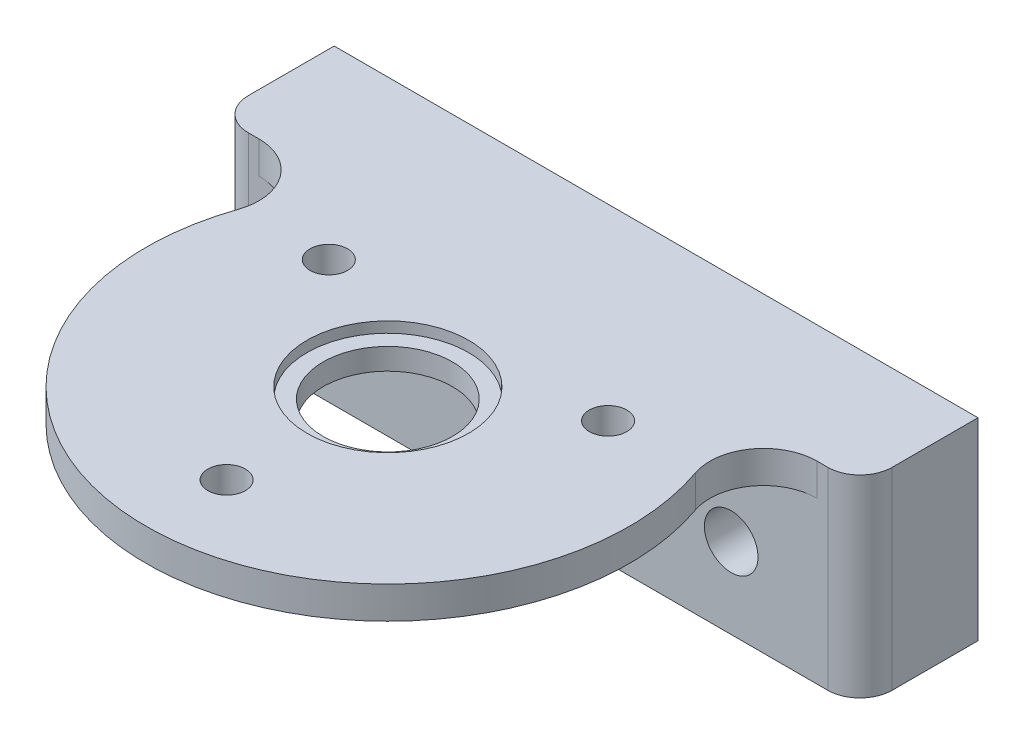
ISO-10303-21;
HEADER;
FILE_DESCRIPTION(('STEP AP214'),'2;1');
FILE_NAME('part.step','',(''),(''),'','','');
FILE_SCHEMA(('AUTOMOTIVE_DESIGN { 1 0 10303 214 1 1 1 1 }'));
ENDSEC;
DATA;
#1=APPLICATION_CONTEXT('core data for automotive mechanical design processes');
#2=APPLICATION_PROTOCOL_DEFINITION('international standard','automotive_design',2000,#1);
#3=PRODUCT_CONTEXT('',#1,'mechanical');
#4=PRODUCT('Part','Part','',(#3));
#5=PRODUCT_RELATED_PRODUCT_CATEGORY('part','',(#4));
#6=PRODUCT_DEFINITION_FORMATION('','',#4);
#7=PRODUCT_DEFINITION_CONTEXT('part definition',#1,'design');
#8=PRODUCT_DEFINITION('design','',#6,#7);
#9=PRODUCT_DEFINITION_SHAPE('','',#8);
#10=(LENGTH_UNIT() NAMED_UNIT(*) SI_UNIT(.MILLI.,.METRE.));
#11=(NAMED_UNIT(*) PLANE_ANGLE_UNIT() SI_UNIT($,.RADIAN.));
#12=(NAMED_UNIT(*) SI_UNIT($,.STERADIAN.) SOLID_ANGLE_UNIT());
#13=UNCERTAINTY_MEASURE_WITH_UNIT(LENGTH_MEASURE(1.E-05),#10,'distance_accuracy_value','');
#14=(GEOMETRIC_REPRESENTATION_CONTEXT(3) GLOBAL_UNCERTAINTY_ASSIGNED_CONTEXT((#13)) GLOBAL_UNIT_ASSIGNED_CONTEXT((#10,
#11,#12)) REPRESENTATION_CONTEXT('',''));
#15=CARTESIAN_POINT('',(0.,0.,0.));
#16=DIRECTION('',(0.,0.,1.));
#17=DIRECTION('',(1.,0.,0.));
#18=AXIS2_PLACEMENT_3D('',#15,#16,#17);
#19=CARTESIAN_POINT('',(0.,2.,0.));
#20=DIRECTION('',(0.,-1.,0.));
#21=DIRECTION('',(0.,0.,-1.));
#22=AXIS2_PLACEMENT_3D('',#19,#20,#21);
#23=CYLINDRICAL_SURFACE('',#22,6.025);
#24=CARTESIAN_POINT('',(0.,2.,0.));
#25=DIRECTION('',(0.,1.,0.));
#26=DIRECTION('',(0.,0.,1.));
#27=AXIS2_PLACEMENT_3D('',#24,#25,#26);
#28=CIRCLE('',#27,6.025);
#29=CARTESIAN_POINT('',(0.,2.,6.025));
#30=VERTEX_POINT('',#29);
#31=EDGE_CURVE('E183',#30,#30,#28,.T.);
#32=ORIENTED_EDGE('',*,*,#31,.T.);
#33=EDGE_LOOP('',(#32));
#34=FACE_BOUND('',#33,.T.);
#35=CARTESIAN_POINT('',(0.,0.,0.));
#36=DIRECTION('',(0.,1.,0.));
#37=DIRECTION('',(0.,0.,1.));
#38=AXIS2_PLACEMENT_3D('',#35,#36,#37);
#39=CIRCLE('',#38,6.025);
#40=CARTESIAN_POINT('',(0.,0.,6.025));
#41=VERTEX_POINT('',#40);
#42=EDGE_CURVE('E182',#41,#41,#39,.T.);
#43=ORIENTED_EDGE('',*,*,#42,.F.);
#44=EDGE_LOOP('',(#43));
#45=FACE_BOUND('',#44,.T.);
#46=ADVANCED_FACE('F39',(#34,#45),#23,.F.);
#47=CARTESIAN_POINT('',(0.,2.,0.));
#48=DIRECTION('',(0.,1.,0.));
#49=DIRECTION('',(0.,0.,1.));
#50=AXIS2_PLACEMENT_3D('',#47,#48,#49);
#51=PLANE('',#50);
#52=ORIENTED_EDGE('',*,*,#31,.F.);
#53=EDGE_LOOP('',(#52));
#54=FACE_BOUND('',#53,.T.);
#55=CARTESIAN_POINT('',(0.,2.,0.));
#56=DIRECTION('',(0.,1.,0.));
#57=DIRECTION('',(0.,0.,1.));
#58=AXIS2_PLACEMENT_3D('',#55,#56,#57);
#59=CIRCLE('',#58,7.525);
#60=CARTESIAN_POINT('',(0.,2.,7.525));
#61=VERTEX_POINT('',#60);
#62=EDGE_CURVE('E177',#61,#61,#59,.F.);
#63=ORIENTED_EDGE('',*,*,#62,.F.);
#64=EDGE_LOOP('',(#63));
#65=FACE_BOUND('',#64,.T.);
#66=ADVANCED_FACE('F275',(#54,#65),#51,.T.);
#67=CARTESIAN_POINT('',(0.,0.,0.));
#68=DIRECTION('',(0.,1.,0.));
#69=DIRECTION('',(0.,0.,1.));
#70=AXIS2_PLACEMENT_3D('',#67,#68,#69);
#71=PLANE('',#70);
#72=CARTESIAN_POINT('',(-13.0120316918612,0.,-7.51250000000006));
#73=DIRECTION('',(0.,1.,0.));
#74=DIRECTION('',(0.,0.,1.));
#75=AXIS2_PLACEMENT_3D('',#72,#73,#74);
#76=CIRCLE('',#75,1.75);
#77=CARTESIAN_POINT('',(-13.0120316918612,0.,-5.76250000000006));
#78=VERTEX_POINT('',#77);
#79=EDGE_CURVE('E161',#78,#78,#76,.T.);
#80=ORIENTED_EDGE('',*,*,#79,.T.);
#81=EDGE_LOOP('',(#80));
#82=FACE_BOUND('',#81,.T.);
#83=CARTESIAN_POINT('',(13.0120316918613,0.,-7.51249999999988));
#84=DIRECTION('',(0.,1.,0.));
#85=DIRECTION('',(0.,0.,1.));
#86=AXIS2_PLACEMENT_3D('',#83,#84,#85);
#87=CIRCLE('',#86,1.75);
#88=CARTESIAN_POINT('',(13.0120316918613,0.,-5.76249999999988));
#89=VERTEX_POINT('',#88);
#90=EDGE_CURVE('E156',#89,#89,#87,.T.);
#91=ORIENTED_EDGE('',*,*,#90,.T.);
#92=EDGE_LOOP('',(#91));
#93=FACE_BOUND('',#92,.T.);
#94=CARTESIAN_POINT('',(0.,0.,15.025));
#95=DIRECTION('',(0.,1.,0.));
#96=DIRECTION('',(0.,0.,1.));
#97=AXIS2_PLACEMENT_3D('',#94,#95,#96);
#98=CIRCLE('',#97,1.75);
#99=CARTESIAN_POINT('',(0.,0.,16.775));
#100=VERTEX_POINT('',#99);
#101=EDGE_CURVE('E167',#100,#100,#98,.T.);
#102=ORIENTED_EDGE('',*,*,#101,.T.);
#103=EDGE_LOOP('',(#102));
#104=FACE_BOUND('',#103,.T.);
#105=ORIENTED_EDGE('',*,*,#42,.T.);
#106=EDGE_LOOP('',(#105));
#107=FACE_BOUND('',#106,.T.);
#108=CARTESIAN_POINT('',(0.,0.,0.));
#109=DIRECTION('',(0.,1.,0.));
#110=DIRECTION('',(0.,0.,1.));
#111=AXIS2_PLACEMENT_3D('',#108,#109,#110);
#112=CIRCLE('',#111,22.525);
#113=CARTESIAN_POINT('',(-21.2868643499736,0.,-7.36512261580381));
#114=VERTEX_POINT('',#113);
#115=CARTESIAN_POINT('',(21.2868643499736,0.,-7.36512261580381));
#116=VERTEX_POINT('',#115);
#117=EDGE_CURVE('E171',#114,#116,#112,.T.);
#118=ORIENTED_EDGE('',*,*,#117,.F.);
#119=CARTESIAN_POINT('',(-26.0120284676147,0.,-9.));
#120=DIRECTION('',(0.,1.,0.));
#121=DIRECTION('',(0.,0.,1.));
#122=AXIS2_PLACEMENT_3D('',#119,#120,#121);
#123=CIRCLE('',#122,5.);
#124=CARTESIAN_POINT('',(-26.0120284676147,0.,-14.));
#125=VERTEX_POINT('',#124);
#126=EDGE_CURVE('E47',#114,#125,#123,.T.);
#127=ORIENTED_EDGE('',*,*,#126,.T.);
#128=DIRECTION('',(1.,0.,0.));
#129=VECTOR('',#128,1.);
#130=CARTESIAN_POINT('',(0.,0.,-14.));
#131=LINE('',#130,#129);
#132=CARTESIAN_POINT('',(26.0120284676147,0.,-14.));
#133=VERTEX_POINT('',#132);
#134=EDGE_CURVE('E54',#125,#133,#131,.T.);
#135=ORIENTED_EDGE('',*,*,#134,.T.);
#136=CARTESIAN_POINT('',(26.0120284676147,0.,-8.99999999999999));
#137=DIRECTION('',(0.,1.,0.));
#138=DIRECTION('',(0.,0.,1.));
#139=AXIS2_PLACEMENT_3D('',#136,#137,#138);
#140=CIRCLE('',#139,5.);
#141=EDGE_CURVE('E218',#133,#116,#140,.T.);
#142=ORIENTED_EDGE('',*,*,#141,.T.);
#143=EDGE_LOOP('',(#118,#127,#135,#142));
#144=FACE_BOUND('',#143,.T.);
#145=ADVANCED_FACE('F221',(#82,#93,#104,#107,#144),#71,.F.);
#146=CARTESIAN_POINT('',(0.,67.7103209849079,0.));
#147=DIRECTION('',(0.,-1.,0.));
#148=DIRECTION('',(0.,0.,-1.));
#149=AXIS2_PLACEMENT_3D('',#146,#147,#148);
#150=CYLINDRICAL_SURFACE('',#149,7.525);
#151=ORIENTED_EDGE('',*,*,#62,.T.);
#152=EDGE_LOOP('',(#151));
#153=FACE_BOUND('',#152,.T.);
#154=CARTESIAN_POINT('',(0.,3.,0.));
#155=DIRECTION('',(0.,1.,0.));
#156=DIRECTION('',(0.,0.,1.));
#157=AXIS2_PLACEMENT_3D('',#154,#155,#156);
#158=CIRCLE('',#157,7.525);
#159=CARTESIAN_POINT('',(0.,3.,7.525));
#160=VERTEX_POINT('',#159);
#161=EDGE_CURVE('E170',#160,#160,#158,.T.);
#162=ORIENTED_EDGE('',*,*,#161,.T.);
#163=EDGE_LOOP('',(#162));
#164=FACE_BOUND('',#163,.T.);
#165=ADVANCED_FACE('F327',(#153,#164),#150,.F.);
#166=CARTESIAN_POINT('',(0.,67.7103209849079,0.));
#167=DIRECTION('',(0.,-1.,0.));
#168=DIRECTION('',(0.,0.,-1.));
#169=AXIS2_PLACEMENT_3D('',#166,#167,#168);
#170=CYLINDRICAL_SURFACE('',#169,22.525);
#171=ORIENTED_EDGE('',*,*,#117,.T.);
#172=DIRECTION('',(0.,-1.,0.));
#173=VECTOR('',#172,1.);
#174=CARTESIAN_POINT('',(21.2868643499736,67.7103209849079,-7.36512261580381));
#175=LINE('',#174,#173);
#176=CARTESIAN_POINT('',(21.2868643499736,3.,-7.36512261580381));
#177=VERTEX_POINT('',#176);
#178=EDGE_CURVE('E209',#116,#177,#175,.F.);
#179=ORIENTED_EDGE('',*,*,#178,.T.);
#180=CARTESIAN_POINT('',(0.,3.,0.));
#181=DIRECTION('',(0.,1.,0.));
#182=DIRECTION('',(0.,0.,1.));
#183=AXIS2_PLACEMENT_3D('',#180,#181,#182);
#184=CIRCLE('',#183,22.525);
#185=CARTESIAN_POINT('',(-21.2868643499736,3.,-7.36512261580381));
#186=VERTEX_POINT('',#185);
#187=EDGE_CURVE('E174',#186,#177,#184,.T.);
#188=ORIENTED_EDGE('',*,*,#187,.F.);
#189=DIRECTION('',(0.,-1.,0.));
#190=VECTOR('',#189,1.);
#191=CARTESIAN_POINT('',(-21.2868643499736,67.7103209849079,-7.36512261580382));
#192=LINE('',#191,#190);
#193=EDGE_CURVE('E206',#186,#114,#192,.T.);
#194=ORIENTED_EDGE('',*,*,#193,.T.);
#195=EDGE_LOOP('',(#171,#179,#188,#194));
#196=FACE_BOUND('',#195,.T.);
#197=ADVANCED_FACE('F301',(#196),#170,.T.);
#198=CARTESIAN_POINT('',(0.,3.,0.));
#199=DIRECTION('',(0.,1.,0.));
#200=DIRECTION('',(0.,0.,1.));
#201=AXIS2_PLACEMENT_3D('',#198,#199,#200);
#202=PLANE('',#201);
#203=DIRECTION('',(0.,0.,-1.));
#204=VECTOR('',#203,1.);
#205=CARTESIAN_POINT('',(-30.,3.,-25.));
#206=LINE('',#205,#204);
#207=CARTESIAN_POINT('',(-30.,3.,-17.));
#208=VERTEX_POINT('',#207);
#209=CARTESIAN_POINT('',(-30.,3.,-25.));
#210=VERTEX_POINT('',#209);
#211=EDGE_CURVE('E129',#208,#210,#206,.T.);
#212=ORIENTED_EDGE('',*,*,#211,.F.);
#213=CARTESIAN_POINT('',(-27.,3.,-17.));
#214=DIRECTION('',(0.,1.,0.));
#215=DIRECTION('',(0.,0.,1.));
#216=AXIS2_PLACEMENT_3D('',#213,#214,#215);
#217=CIRCLE('',#216,3.);
#218=CARTESIAN_POINT('',(-27.,3.,-14.));
#219=VERTEX_POINT('',#218);
#220=EDGE_CURVE('E200',#208,#219,#217,.T.);
#221=ORIENTED_EDGE('',*,*,#220,.T.);
#222=DIRECTION('',(-1.,0.,0.));
#223=VECTOR('',#222,1.);
#224=CARTESIAN_POINT('',(-30.,3.,-14.));
#225=LINE('',#224,#223);
#226=CARTESIAN_POINT('',(-26.0120284676147,3.,-14.));
#227=VERTEX_POINT('',#226);
#228=EDGE_CURVE('E138',#227,#219,#225,.T.);
#229=ORIENTED_EDGE('',*,*,#228,.F.);
#230=CARTESIAN_POINT('',(-26.0120284676147,3.,-9.));
#231=DIRECTION('',(0.,1.,0.));
#232=DIRECTION('',(0.,0.,1.));
#233=AXIS2_PLACEMENT_3D('',#230,#231,#232);
#234=CIRCLE('',#233,5.);
#235=EDGE_CURVE('E12',#227,#186,#234,.F.);
#236=ORIENTED_EDGE('',*,*,#235,.T.);
#237=ORIENTED_EDGE('',*,*,#187,.T.);
#238=CARTESIAN_POINT('',(26.0120284676147,3.,-8.99999999999999));
#239=DIRECTION('',(0.,1.,0.));
#240=DIRECTION('',(0.,0.,1.));
#241=AXIS2_PLACEMENT_3D('',#238,#239,#240);
#242=CIRCLE('',#241,5.);
#243=CARTESIAN_POINT('',(26.0120284676147,3.,-14.));
#244=VERTEX_POINT('',#243);
#245=EDGE_CURVE('E216',#177,#244,#242,.F.);
#246=ORIENTED_EDGE('',*,*,#245,.T.);
#247=CARTESIAN_POINT('',(27.,3.,-14.));
#248=VERTEX_POINT('',#247);
#249=EDGE_CURVE('E140',#248,#244,#225,.T.);
#250=ORIENTED_EDGE('',*,*,#249,.F.);
#251=CARTESIAN_POINT('',(27.,3.,-17.));
#252=DIRECTION('',(0.,1.,0.));
#253=DIRECTION('',(0.,0.,1.));
#254=AXIS2_PLACEMENT_3D('',#251,#252,#253);
#255=CIRCLE('',#254,3.);
#256=CARTESIAN_POINT('',(30.,3.,-17.));
#257=VERTEX_POINT('',#256);
#258=EDGE_CURVE('E198',#248,#257,#255,.T.);
#259=ORIENTED_EDGE('',*,*,#258,.T.);
#260=DIRECTION('',(0.,0.,1.));
#261=VECTOR('',#260,1.);
#262=CARTESIAN_POINT('',(30.,3.,-25.));
#263=LINE('',#262,#261);
#264=CARTESIAN_POINT('',(30.,3.,-25.));
#265=VERTEX_POINT('',#264);
#266=EDGE_CURVE('E145',#265,#257,#263,.T.);
#267=ORIENTED_EDGE('',*,*,#266,.F.);
#268=DIRECTION('',(1.,0.,0.));
#269=VECTOR('',#268,1.);
#270=CARTESIAN_POINT('',(-30.,3.,-25.));
#271=LINE('',#270,#269);
#272=EDGE_CURVE('E133',#210,#265,#271,.T.);
#273=ORIENTED_EDGE('',*,*,#272,.F.);
#274=EDGE_LOOP('',(#212,#221,#229,#236,#237,#246,#250,#259,#267,#273));
#275=FACE_BOUND('',#274,.T.);
#276=CARTESIAN_POINT('',(-13.0120316918612,3.,-7.51250000000006));
#277=DIRECTION('',(0.,1.,0.));
#278=DIRECTION('',(-0.866025403784436,0.,-0.500000000000004));
#279=AXIS2_PLACEMENT_3D('',#276,#277,#278);
#280=CIRCLE('',#279,1.75);
#281=CARTESIAN_POINT('',(-14.5275761484839,3.,-8.38750000000007));
#282=VERTEX_POINT('',#281);
#283=EDGE_CURVE('E153',#282,#282,#280,.T.);
#284=ORIENTED_EDGE('',*,*,#283,.F.);
#285=EDGE_LOOP('',(#284));
#286=FACE_BOUND('',#285,.T.);
#287=CARTESIAN_POINT('',(13.0120316918613,3.,-7.51249999999988));
#288=DIRECTION('',(0.,1.,0.));
#289=DIRECTION('',(0.866025403784443,0.,-0.499999999999992));
#290=AXIS2_PLACEMENT_3D('',#287,#288,#289);
#291=CIRCLE('',#290,1.75);
#292=CARTESIAN_POINT('',(14.527576148484,3.,-8.38749999999987));
#293=VERTEX_POINT('',#292);
#294=EDGE_CURVE('E152',#293,#293,#291,.T.);
#295=ORIENTED_EDGE('',*,*,#294,.F.);
#296=EDGE_LOOP('',(#295));
#297=FACE_BOUND('',#296,.T.);
#298=CARTESIAN_POINT('',(0.,3.,15.025));
#299=DIRECTION('',(0.,1.,0.));
#300=DIRECTION('',(0.,0.,1.));
#301=AXIS2_PLACEMENT_3D('',#298,#299,#300);
#302=CIRCLE('',#301,1.75);
#303=CARTESIAN_POINT('',(0.,3.,16.775));
#304=VERTEX_POINT('',#303);
#305=EDGE_CURVE('E164',#304,#304,#302,.T.);
#306=ORIENTED_EDGE('',*,*,#305,.F.);
#307=EDGE_LOOP('',(#306));
#308=FACE_BOUND('',#307,.T.);
#309=ORIENTED_EDGE('',*,*,#161,.F.);
#310=EDGE_LOOP('',(#309));
#311=FACE_BOUND('',#310,.T.);
#312=ADVANCED_FACE('F228',(#275,#286,#297,#308,#311),#202,.T.);
#313=CARTESIAN_POINT('',(0.,-1.5,15.025));
#314=DIRECTION('',(0.,1.,0.));
#315=DIRECTION('',(0.,0.,1.));
#316=AXIS2_PLACEMENT_3D('',#313,#314,#315);
#317=CYLINDRICAL_SURFACE('',#316,1.75);
#318=ORIENTED_EDGE('',*,*,#305,.T.);
#319=EDGE_LOOP('',(#318));
#320=FACE_BOUND('',#319,.T.);
#321=ORIENTED_EDGE('',*,*,#101,.F.);
#322=EDGE_LOOP('',(#321));
#323=FACE_BOUND('',#322,.T.);
#324=ADVANCED_FACE('F322',(#320,#323),#317,.F.);
#325=CARTESIAN_POINT('',(13.0120316918613,-1.5,-7.51249999999988));
#326=DIRECTION('',(0.,1.,0.));
#327=DIRECTION('',(0.,0.,1.));
#328=AXIS2_PLACEMENT_3D('',#325,#326,#327);
#329=CYLINDRICAL_SURFACE('',#328,1.75);
#330=ORIENTED_EDGE('',*,*,#294,.T.);
#331=EDGE_LOOP('',(#330));
#332=FACE_BOUND('',#331,.T.);
#333=ORIENTED_EDGE('',*,*,#90,.F.);
#334=EDGE_LOOP('',(#333));
#335=FACE_BOUND('',#334,.T.);
#336=ADVANCED_FACE('F318',(#332,#335),#329,.F.);
#337=CARTESIAN_POINT('',(-13.0120316918612,-1.5,-7.51250000000006));
#338=DIRECTION('',(0.,1.,0.));
#339=DIRECTION('',(0.,0.,1.));
#340=AXIS2_PLACEMENT_3D('',#337,#338,#339);
#341=CYLINDRICAL_SURFACE('',#340,1.75);
#342=ORIENTED_EDGE('',*,*,#283,.T.);
#343=EDGE_LOOP('',(#342));
#344=FACE_BOUND('',#343,.T.);
#345=ORIENTED_EDGE('',*,*,#79,.F.);
#346=EDGE_LOOP('',(#345));
#347=FACE_BOUND('',#346,.T.);
#348=ADVANCED_FACE('F257',(#344,#347),#341,.F.);
#349=CARTESIAN_POINT('',(-30.,64.,-14.));
#350=DIRECTION('',(0.,0.,1.));
#351=DIRECTION('',(1.,0.,0.));
#352=AXIS2_PLACEMENT_3D('',#349,#350,#351);
#353=PLANE('',#352);
#354=CARTESIAN_POINT('',(-18.,-7.5,-14.));
#355=DIRECTION('',(0.,0.,1.));
#356=DIRECTION('',(1.,0.,0.));
#357=AXIS2_PLACEMENT_3D('',#354,#355,#356);
#358=CIRCLE('',#357,2.5);
#359=CARTESIAN_POINT('',(-15.5,-7.5,-14.));
#360=VERTEX_POINT('',#359);
#361=EDGE_CURVE('E238',#360,#360,#358,.T.);
#362=ORIENTED_EDGE('',*,*,#361,.F.);
#363=EDGE_LOOP('',(#362));
#364=FACE_BOUND('',#363,.T.);
#365=CARTESIAN_POINT('',(18.,-7.49999999999999,-14.));
#366=DIRECTION('',(0.,0.,1.));
#367=DIRECTION('',(-1.,0.,0.));
#368=AXIS2_PLACEMENT_3D('',#365,#366,#367);
#369=CIRCLE('',#368,2.5);
#370=CARTESIAN_POINT('',(15.5,-7.49999999999999,-14.));
#371=VERTEX_POINT('',#370);
#372=EDGE_CURVE('E244',#371,#371,#369,.T.);
#373=ORIENTED_EDGE('',*,*,#372,.F.);
#374=EDGE_LOOP('',(#373));
#375=FACE_BOUND('',#374,.T.);
#376=ORIENTED_EDGE('',*,*,#249,.T.);
#377=DIRECTION('',(0.,-1.,0.));
#378=VECTOR('',#377,1.);
#379=CARTESIAN_POINT('',(26.0120284676147,64.,-14.));
#380=LINE('',#379,#378);
#381=EDGE_CURVE('E214',#244,#133,#380,.T.);
#382=ORIENTED_EDGE('',*,*,#381,.T.);
#383=ORIENTED_EDGE('',*,*,#134,.F.);
#384=DIRECTION('',(0.,-1.,0.));
#385=VECTOR('',#384,1.);
#386=CARTESIAN_POINT('',(-26.0120284676147,64.,-14.));
#387=LINE('',#386,#385);
#388=EDGE_CURVE('E212',#125,#227,#387,.F.);
#389=ORIENTED_EDGE('',*,*,#388,.T.);
#390=ORIENTED_EDGE('',*,*,#228,.T.);
#391=DIRECTION('',(0.,-1.,0.));
#392=VECTOR('',#391,1.);
#393=CARTESIAN_POINT('',(-27.,64.,-14.));
#394=LINE('',#393,#392);
#395=CARTESIAN_POINT('',(-27.,-15.,-14.));
#396=VERTEX_POINT('',#395);
#397=EDGE_CURVE('E190',#219,#396,#394,.T.);
#398=ORIENTED_EDGE('',*,*,#397,.T.);
#399=DIRECTION('',(-1.,0.,0.));
#400=VECTOR('',#399,1.);
#401=CARTESIAN_POINT('',(-30.,-15.,-14.));
#402=LINE('',#401,#400);
#403=CARTESIAN_POINT('',(27.,-15.,-14.));
#404=VERTEX_POINT('',#403);
#405=EDGE_CURVE('E123',#404,#396,#402,.T.);
#406=ORIENTED_EDGE('',*,*,#405,.F.);
#407=DIRECTION('',(0.,-1.,0.));
#408=VECTOR('',#407,1.);
#409=CARTESIAN_POINT('',(27.,64.,-14.));
#410=LINE('',#409,#408);
#411=EDGE_CURVE('E186',#404,#248,#410,.F.);
#412=ORIENTED_EDGE('',*,*,#411,.T.);
#413=EDGE_LOOP('',(#376,#382,#383,#389,#390,#398,#406,#412));
#414=FACE_BOUND('',#413,.T.);
#415=ADVANCED_FACE('F226',(#364,#375,#414),#353,.T.);
#416=CARTESIAN_POINT('',(-30.,64.,-25.));
#417=DIRECTION('',(-1.,0.,0.));
#418=DIRECTION('',(0.,0.,1.));
#419=AXIS2_PLACEMENT_3D('',#416,#417,#418);
#420=PLANE('',#419);
#421=DIRECTION('',(0.,0.,-1.));
#422=VECTOR('',#421,1.);
#423=CARTESIAN_POINT('',(-30.,-15.,-25.));
#424=LINE('',#423,#422);
#425=CARTESIAN_POINT('',(-30.,-15.,-17.));
#426=VERTEX_POINT('',#425);
#427=CARTESIAN_POINT('',(-30.,-15.,-25.));
#428=VERTEX_POINT('',#427);
#429=EDGE_CURVE('E112',#426,#428,#424,.T.);
#430=ORIENTED_EDGE('',*,*,#429,.F.);
#431=DIRECTION('',(0.,-1.,0.));
#432=VECTOR('',#431,1.);
#433=CARTESIAN_POINT('',(-30.,64.,-17.));
#434=LINE('',#433,#432);
#435=EDGE_CURVE('E196',#426,#208,#434,.F.);
#436=ORIENTED_EDGE('',*,*,#435,.T.);
#437=ORIENTED_EDGE('',*,*,#211,.T.);
#438=DIRECTION('',(0.,-1.,0.));
#439=VECTOR('',#438,1.);
#440=CARTESIAN_POINT('',(-30.,64.,-25.));
#441=LINE('',#440,#439);
#442=EDGE_CURVE('E126',#210,#428,#441,.T.);
#443=ORIENTED_EDGE('',*,*,#442,.T.);
#444=EDGE_LOOP('',(#430,#436,#437,#443));
#445=FACE_BOUND('',#444,.T.);
#446=ADVANCED_FACE('F127',(#445),#420,.T.);
#447=CARTESIAN_POINT('',(-30.,64.,-25.));
#448=DIRECTION('',(0.,0.,-1.));
#449=DIRECTION('',(-1.,0.,0.));
#450=AXIS2_PLACEMENT_3D('',#447,#448,#449);
#451=PLANE('',#450);
#452=CARTESIAN_POINT('',(-18.,-7.5,-25.));
#453=DIRECTION('',(0.,0.,-1.));
#454=DIRECTION('',(-1.,0.,0.));
#455=AXIS2_PLACEMENT_3D('',#452,#453,#454);
#456=CIRCLE('',#455,2.5);
#457=CARTESIAN_POINT('',(-20.5,-7.5,-25.));
#458=VERTEX_POINT('',#457);
#459=EDGE_CURVE('E247',#458,#458,#456,.F.);
#460=ORIENTED_EDGE('',*,*,#459,.T.);
#461=EDGE_LOOP('',(#460));
#462=FACE_BOUND('',#461,.T.);
#463=CARTESIAN_POINT('',(18.,-7.49999999999999,-25.));
#464=DIRECTION('',(0.,0.,-1.));
#465=DIRECTION('',(-1.,0.,0.));
#466=AXIS2_PLACEMENT_3D('',#463,#464,#465);
#467=CIRCLE('',#466,2.5);
#468=CARTESIAN_POINT('',(15.5,-7.49999999999999,-25.));
#469=VERTEX_POINT('',#468);
#470=EDGE_CURVE('E241',#469,#469,#467,.F.);
#471=ORIENTED_EDGE('',*,*,#470,.T.);
#472=EDGE_LOOP('',(#471));
#473=FACE_BOUND('',#472,.T.);
#474=ORIENTED_EDGE('',*,*,#442,.F.);
#475=ORIENTED_EDGE('',*,*,#272,.T.);
#476=DIRECTION('',(0.,-1.,0.));
#477=VECTOR('',#476,1.);
#478=CARTESIAN_POINT('',(30.,64.,-25.));
#479=LINE('',#478,#477);
#480=CARTESIAN_POINT('',(30.,-15.,-25.));
#481=VERTEX_POINT('',#480);
#482=EDGE_CURVE('E137',#265,#481,#479,.T.);
#483=ORIENTED_EDGE('',*,*,#482,.T.);
#484=DIRECTION('',(1.,0.,0.));
#485=VECTOR('',#484,1.);
#486=CARTESIAN_POINT('',(-30.,-15.,-25.));
#487=LINE('',#486,#485);
#488=EDGE_CURVE('E118',#428,#481,#487,.T.);
#489=ORIENTED_EDGE('',*,*,#488,.F.);
#490=EDGE_LOOP('',(#474,#475,#483,#489));
#491=FACE_BOUND('',#490,.T.);
#492=ADVANCED_FACE('F135',(#462,#473,#491),#451,.T.);
#493=CARTESIAN_POINT('',(30.,64.,-25.));
#494=DIRECTION('',(1.,0.,0.));
#495=DIRECTION('',(0.,0.,-1.));
#496=AXIS2_PLACEMENT_3D('',#493,#494,#495);
#497=PLANE('',#496);
#498=ORIENTED_EDGE('',*,*,#266,.T.);
#499=DIRECTION('',(0.,-1.,0.));
#500=VECTOR('',#499,1.);
#501=CARTESIAN_POINT('',(30.,64.,-17.));
#502=LINE('',#501,#500);
#503=CARTESIAN_POINT('',(30.,-15.,-17.));
#504=VERTEX_POINT('',#503);
#505=EDGE_CURVE('E203',#257,#504,#502,.T.);
#506=ORIENTED_EDGE('',*,*,#505,.T.);
#507=DIRECTION('',(0.,0.,1.));
#508=VECTOR('',#507,1.);
#509=CARTESIAN_POINT('',(30.,-15.,-25.));
#510=LINE('',#509,#508);
#511=EDGE_CURVE('E237',#481,#504,#510,.T.);
#512=ORIENTED_EDGE('',*,*,#511,.F.);
#513=ORIENTED_EDGE('',*,*,#482,.F.);
#514=EDGE_LOOP('',(#498,#506,#512,#513));
#515=FACE_BOUND('',#514,.T.);
#516=ADVANCED_FACE('F271',(#515),#497,.T.);
#517=CARTESIAN_POINT('',(0.,-15.,0.));
#518=DIRECTION('',(0.,1.,0.));
#519=DIRECTION('',(0.,0.,1.));
#520=AXIS2_PLACEMENT_3D('',#517,#518,#519);
#521=PLANE('',#520);
#522=ORIENTED_EDGE('',*,*,#405,.T.);
#523=CARTESIAN_POINT('',(-27.,-15.,-17.));
#524=DIRECTION('',(0.,1.,0.));
#525=DIRECTION('',(0.,0.,1.));
#526=AXIS2_PLACEMENT_3D('',#523,#524,#525);
#527=CIRCLE('',#526,3.);
#528=EDGE_CURVE('E120',#396,#426,#527,.F.);
#529=ORIENTED_EDGE('',*,*,#528,.T.);
#530=ORIENTED_EDGE('',*,*,#429,.T.);
#531=ORIENTED_EDGE('',*,*,#488,.T.);
#532=ORIENTED_EDGE('',*,*,#511,.T.);
#533=CARTESIAN_POINT('',(27.,-15.,-17.));
#534=DIRECTION('',(0.,1.,0.));
#535=DIRECTION('',(0.,0.,1.));
#536=AXIS2_PLACEMENT_3D('',#533,#534,#535);
#537=CIRCLE('',#536,3.);
#538=EDGE_CURVE('E193',#504,#404,#537,.F.);
#539=ORIENTED_EDGE('',*,*,#538,.T.);
#540=EDGE_LOOP('',(#522,#529,#530,#531,#532,#539));
#541=FACE_BOUND('',#540,.T.);
#542=ADVANCED_FACE('F115',(#541),#521,.F.);
#543=CARTESIAN_POINT('',(18.,-7.49999999999999,-25.001));
#544=DIRECTION('',(0.,0.,1.));
#545=DIRECTION('',(1.,0.,0.));
#546=AXIS2_PLACEMENT_3D('',#543,#544,#545);
#547=CYLINDRICAL_SURFACE('',#546,2.5);
#548=ORIENTED_EDGE('',*,*,#470,.F.);
#549=EDGE_LOOP('',(#548));
#550=FACE_BOUND('',#549,.T.);
#551=ORIENTED_EDGE('',*,*,#372,.T.);
#552=EDGE_LOOP('',(#551));
#553=FACE_BOUND('',#552,.T.);
#554=ADVANCED_FACE('F261',(#550,#553),#547,.F.);
#555=CARTESIAN_POINT('',(-18.,-7.5,-25.001));
#556=DIRECTION('',(0.,0.,1.));
#557=DIRECTION('',(1.,0.,0.));
#558=AXIS2_PLACEMENT_3D('',#555,#556,#557);
#559=CYLINDRICAL_SURFACE('',#558,2.5);
#560=ORIENTED_EDGE('',*,*,#459,.F.);
#561=EDGE_LOOP('',(#560));
#562=FACE_BOUND('',#561,.T.);
#563=ORIENTED_EDGE('',*,*,#361,.T.);
#564=EDGE_LOOP('',(#563));
#565=FACE_BOUND('',#564,.T.);
#566=ADVANCED_FACE('F253',(#562,#565),#559,.F.);
#567=CARTESIAN_POINT('',(-27.,64.,-17.));
#568=DIRECTION('',(0.,-1.,0.));
#569=DIRECTION('',(0.,0.,-1.));
#570=AXIS2_PLACEMENT_3D('',#567,#568,#569);
#571=CYLINDRICAL_SURFACE('',#570,3.);
#572=ORIENTED_EDGE('',*,*,#220,.F.);
#573=ORIENTED_EDGE('',*,*,#435,.F.);
#574=ORIENTED_EDGE('',*,*,#528,.F.);
#575=ORIENTED_EDGE('',*,*,#397,.F.);
#576=EDGE_LOOP('',(#572,#573,#574,#575));
#577=FACE_BOUND('',#576,.T.);
#578=ADVANCED_FACE('F234',(#577),#571,.T.);
#579=CARTESIAN_POINT('',(27.,64.,-17.));
#580=DIRECTION('',(0.,-1.,0.));
#581=DIRECTION('',(0.,0.,-1.));
#582=AXIS2_PLACEMENT_3D('',#579,#580,#581);
#583=CYLINDRICAL_SURFACE('',#582,3.);
#584=ORIENTED_EDGE('',*,*,#258,.F.);
#585=ORIENTED_EDGE('',*,*,#411,.F.);
#586=ORIENTED_EDGE('',*,*,#538,.F.);
#587=ORIENTED_EDGE('',*,*,#505,.F.);
#588=EDGE_LOOP('',(#584,#585,#586,#587));
#589=FACE_BOUND('',#588,.T.);
#590=ADVANCED_FACE('F288',(#589),#583,.T.);
#591=CARTESIAN_POINT('',(26.0120284676147,67.7103209849079,-8.99999999999999));
#592=DIRECTION('',(0.,-1.,0.));
#593=DIRECTION('',(0.,0.,-1.));
#594=AXIS2_PLACEMENT_3D('',#591,#592,#593);
#595=CYLINDRICAL_SURFACE('',#594,5.);
#596=ORIENTED_EDGE('',*,*,#141,.F.);
#597=ORIENTED_EDGE('',*,*,#381,.F.);
#598=ORIENTED_EDGE('',*,*,#245,.F.);
#599=ORIENTED_EDGE('',*,*,#178,.F.);
#600=EDGE_LOOP('',(#596,#597,#598,#599));
#601=FACE_BOUND('',#600,.T.);
#602=ADVANCED_FACE('F290',(#601),#595,.F.);
#603=CARTESIAN_POINT('',(-26.0120284676147,67.7103209849079,-9.));
#604=DIRECTION('',(0.,-1.,0.));
#605=DIRECTION('',(0.,0.,-1.));
#606=AXIS2_PLACEMENT_3D('',#603,#604,#605);
#607=CYLINDRICAL_SURFACE('',#606,5.);
#608=ORIENTED_EDGE('',*,*,#235,.F.);
#609=ORIENTED_EDGE('',*,*,#388,.F.);
#610=ORIENTED_EDGE('',*,*,#126,.F.);
#611=ORIENTED_EDGE('',*,*,#193,.F.);
#612=EDGE_LOOP('',(#608,#609,#610,#611));
#613=FACE_BOUND('',#612,.T.);
#614=ADVANCED_FACE('F41',(#613),#607,.F.);
#615=CLOSED_SHELL('',(#46,#66,#145,#165,#197,#312,#324,#336,#348,#415,#446,#492,#516,#542,#554,
#566,#578,#590,#602,#614));
#616=MANIFOLD_SOLID_BREP('B2',#615);
#617=ADVANCED_BREP_SHAPE_REPRESENTATION('',(#18,#616),#14);
#618=SHAPE_DEFINITION_REPRESENTATION(#9,#617);
ENDSEC;
END-ISO-10303-21;
